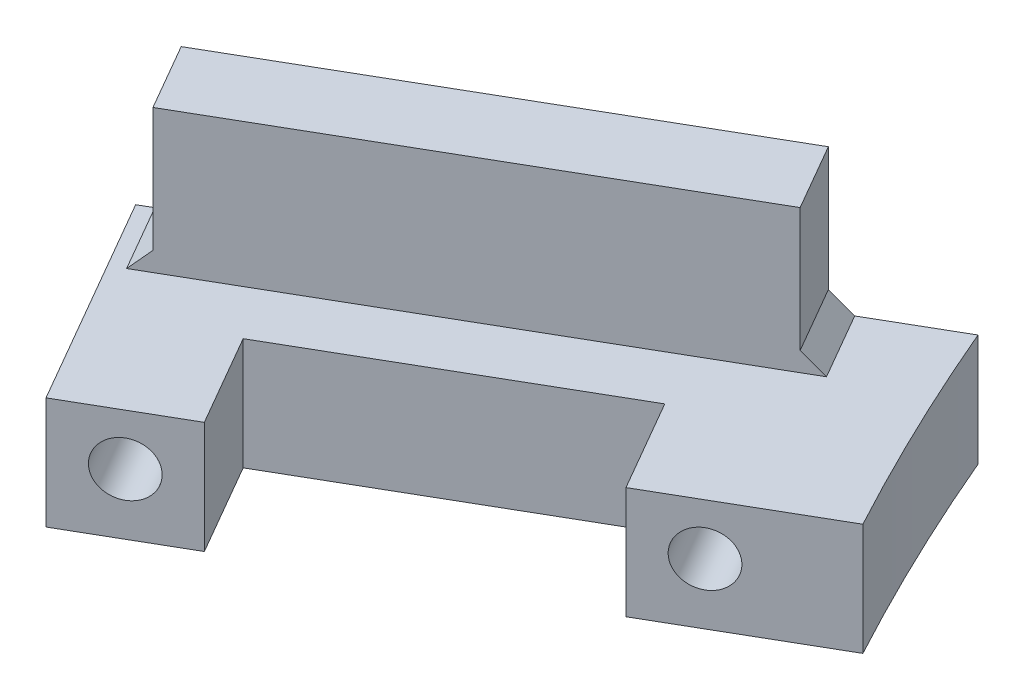
ISO-10303-21;
HEADER;
FILE_DESCRIPTION(('STEP AP214'),'2;1');
FILE_NAME('part.step','',(''),(''),'','','');
FILE_SCHEMA(('AUTOMOTIVE_DESIGN { 1 0 10303 214 1 1 1 1 }'));
ENDSEC;
DATA;
#1=APPLICATION_CONTEXT('core data for automotive mechanical design processes');
#2=APPLICATION_PROTOCOL_DEFINITION('international standard','automotive_design',2000,#1);
#3=PRODUCT_CONTEXT('',#1,'mechanical');
#4=PRODUCT('Part','Part','',(#3));
#5=PRODUCT_RELATED_PRODUCT_CATEGORY('part','',(#4));
#6=PRODUCT_DEFINITION_FORMATION('','',#4);
#7=PRODUCT_DEFINITION_CONTEXT('part definition',#1,'design');
#8=PRODUCT_DEFINITION('design','',#6,#7);
#9=PRODUCT_DEFINITION_SHAPE('','',#8);
#10=(LENGTH_UNIT() NAMED_UNIT(*) SI_UNIT(.MILLI.,.METRE.));
#11=(NAMED_UNIT(*) PLANE_ANGLE_UNIT() SI_UNIT($,.RADIAN.));
#12=(NAMED_UNIT(*) SI_UNIT($,.STERADIAN.) SOLID_ANGLE_UNIT());
#13=UNCERTAINTY_MEASURE_WITH_UNIT(LENGTH_MEASURE(1.E-05),#10,'distance_accuracy_value','');
#14=(GEOMETRIC_REPRESENTATION_CONTEXT(3) GLOBAL_UNCERTAINTY_ASSIGNED_CONTEXT((#13)) GLOBAL_UNIT_ASSIGNED_CONTEXT((#10,
#11,#12)) REPRESENTATION_CONTEXT('',''));
#15=CARTESIAN_POINT('',(0.,0.,0.));
#16=DIRECTION('',(0.,0.,1.));
#17=DIRECTION('',(1.,0.,0.));
#18=AXIS2_PLACEMENT_3D('',#15,#16,#17);
#19=CARTESIAN_POINT('',(4.79598622043922,0.,-14.4019340840513));
#20=DIRECTION('',(-0.866025403784438,0.,0.500000000000001));
#21=DIRECTION('',(0.500000000000001,0.,0.866025403784438));
#22=AXIS2_PLACEMENT_3D('',#19,#20,#21);
#23=PLANE('',#22);
#24=DIRECTION('',(0.500000000000001,0.,0.866025403784438));
#25=VECTOR('',#24,1.);
#26=CARTESIAN_POINT('',(4.79598622043923,2.90000000000004,-14.4019340840513));
#27=LINE('',#26,#25);
#28=CARTESIAN_POINT('',(8.45821005553815,2.90000000000004,-8.05877633297021));
#29=VERTEX_POINT('',#28);
#30=CARTESIAN_POINT('',(9.83321005553811,2.90000000000004,-5.67720647256308));
#31=VERTEX_POINT('',#30);
#32=EDGE_CURVE('E325',#29,#31,#27,.T.);
#33=ORIENTED_EDGE('',*,*,#32,.F.);
#34=DIRECTION('',(0.,-1.,0.));
#35=VECTOR('',#34,1.);
#36=CARTESIAN_POINT('',(8.45821005553814,0.,-8.05877633297021));
#37=LINE('',#36,#35);
#38=CARTESIAN_POINT('',(8.45821005553815,0.,-8.05877633297021));
#39=VERTEX_POINT('',#38);
#40=EDGE_CURVE('E294',#29,#39,#37,.T.);
#41=ORIENTED_EDGE('',*,*,#40,.T.);
#42=DIRECTION('',(0.500000000000001,0.,0.866025403784438));
#43=VECTOR('',#42,1.);
#44=CARTESIAN_POINT('',(4.79598622043922,0.,-14.4019340840513));
#45=LINE('',#44,#43);
#46=CARTESIAN_POINT('',(9.83321005553811,0.,-5.67720647256307));
#47=VERTEX_POINT('',#46);
#48=EDGE_CURVE('E301',#39,#47,#45,.T.);
#49=ORIENTED_EDGE('',*,*,#48,.T.);
#50=DIRECTION('',(0.,-1.,0.));
#51=VECTOR('',#50,1.);
#52=CARTESIAN_POINT('',(9.83321005553811,0.,-5.67720647256307));
#53=LINE('',#52,#51);
#54=EDGE_CURVE('E326',#31,#47,#53,.T.);
#55=ORIENTED_EDGE('',*,*,#54,.F.);
#56=EDGE_LOOP('',(#33,#41,#49,#55));
#57=FACE_BOUND('',#56,.T.);
#58=ADVANCED_FACE('F148',(#57),#23,.T.);
#59=CARTESIAN_POINT('',(-5.03722383509889,0.,-8.7247276114882));
#60=DIRECTION('',(0.,1.,0.));
#61=DIRECTION('',(0.,0.,1.));
#62=AXIS2_PLACEMENT_3D('',#59,#60,#61);
#63=PLANE('',#62);
#64=DIRECTION('',(0.500000000000001,0.,0.866025403784438));
#65=VECTOR('',#64,1.);
#66=CARTESIAN_POINT('',(-4.73411494377403,0.,-8.89972761148837));
#67=LINE('',#66,#65);
#68=CARTESIAN_POINT('',(-2.87089110867512,0.,-5.67252926322374));
#69=VERTEX_POINT('',#68);
#70=CARTESIAN_POINT('',(0.303108891324852,0.,-0.175000000000171));
#71=VERTEX_POINT('',#70);
#72=EDGE_CURVE('E346',#69,#71,#67,.T.);
#73=ORIENTED_EDGE('',*,*,#72,.F.);
#74=DIRECTION('',(-0.866025403784438,0.,0.500000000000001));
#75=VECTOR('',#74,1.);
#76=CARTESIAN_POINT('',(-3.17399999999997,0.,-5.49752926322356));
#77=LINE('',#76,#75);
#78=CARTESIAN_POINT('',(10.9712435700447,0.,-13.6642894461417));
#79=VERTEX_POINT('',#78);
#80=EDGE_CURVE('E355',#79,#69,#77,.T.);
#81=ORIENTED_EDGE('',*,*,#80,.F.);
#82=CARTESIAN_POINT('',(73.755313071795,0.,-40.2732487794075));
#83=DIRECTION('',(0.,1.,0.));
#84=DIRECTION('',(0.,0.,1.));
#85=AXIS2_PLACEMENT_3D('',#82,#83,#84);
#86=CIRCLE('',#85,68.19);
#87=CARTESIAN_POINT('',(13.726446616475,0.,-7.92496764903888));
#88=VERTEX_POINT('',#87);
#89=EDGE_CURVE('E287',#88,#79,#86,.F.);
#90=ORIENTED_EDGE('',*,*,#89,.F.);
#91=DIRECTION('',(-0.866025403784438,0.,0.500000000000001));
#92=VECTOR('',#91,1.);
#93=CARTESIAN_POINT('',(0.,0.,0.));
#94=LINE('',#93,#92);
#95=EDGE_CURVE('E293',#88,#47,#94,.T.);
#96=ORIENTED_EDGE('',*,*,#95,.T.);
#97=ORIENTED_EDGE('',*,*,#48,.F.);
#98=DIRECTION('',(-0.866025403784438,0.,0.500000000000001));
#99=VECTOR('',#98,1.);
#100=CARTESIAN_POINT('',(-1.37499999999996,0.,-2.38156986040714));
#101=LINE('',#100,#99);
#102=CARTESIAN_POINT('',(1.53000682526264,0.,-4.05877633297021));
#103=VERTEX_POINT('',#102);
#104=EDGE_CURVE('E304',#39,#103,#101,.T.);
#105=ORIENTED_EDGE('',*,*,#104,.T.);
#106=DIRECTION('',(0.500000000000001,0.,0.866025403784438));
#107=VECTOR('',#106,1.);
#108=CARTESIAN_POINT('',(-2.13221700983628,0.,-10.4019340840513));
#109=LINE('',#108,#107);
#110=CARTESIAN_POINT('',(2.9050068252626,0.,-1.67720647256307));
#111=VERTEX_POINT('',#110);
#112=EDGE_CURVE('E198',#103,#111,#109,.T.);
#113=ORIENTED_EDGE('',*,*,#112,.T.);
#114=DIRECTION('',(-0.866025403784438,0.,0.500000000000001));
#115=VECTOR('',#114,1.);
#116=CARTESIAN_POINT('',(0.,0.,0.));
#117=LINE('',#116,#115);
#118=EDGE_CURVE('E349',#111,#71,#117,.T.);
#119=ORIENTED_EDGE('',*,*,#118,.T.);
#120=EDGE_LOOP('',(#73,#81,#90,#96,#97,#105,#113,#119));
#121=FACE_BOUND('',#120,.T.);
#122=ADVANCED_FACE('F425',(#121),#63,.F.);
#123=CARTESIAN_POINT('',(6.09502432611589,1.57500000000004,-15.1519340840513));
#124=DIRECTION('',(0.500000000000001,0.,0.866025403784438));
#125=DIRECTION('',(0.866025403784438,0.,-0.500000000000001));
#126=AXIS2_PLACEMENT_3D('',#123,#124,#125);
#127=CYLINDRICAL_SURFACE('',#126,0.700000000000006);
#128=CARTESIAN_POINT('',(11.1322481612148,1.57500000000004,-6.42720647256308));
#129=DIRECTION('',(-0.500000000000001,0.,-0.866025403784438));
#130=DIRECTION('',(-0.866025403784438,0.,0.500000000000001));
#131=AXIS2_PLACEMENT_3D('',#128,#129,#130);
#132=CIRCLE('',#131,0.700000000000006);
#133=CARTESIAN_POINT('',(10.5260303785657,1.57500000000004,-6.07720647256308));
#134=VERTEX_POINT('',#133);
#135=EDGE_CURVE('E324',#134,#134,#132,.T.);
#136=ORIENTED_EDGE('',*,*,#135,.F.);
#137=EDGE_LOOP('',(#136));
#138=FACE_BOUND('',#137,.T.);
#139=CARTESIAN_POINT('',(8.9582481612148,1.57500000000004,-10.1926849282178));
#140=DIRECTION('',(-0.500000000000001,0.,-0.866025403784438));
#141=DIRECTION('',(-0.866025403784438,0.,0.500000000000001));
#142=AXIS2_PLACEMENT_3D('',#139,#140,#141);
#143=CIRCLE('',#142,0.700000000000006);
#144=CARTESIAN_POINT('',(8.35203037856569,1.57500000000004,-9.84268492821776));
#145=VERTEX_POINT('',#144);
#146=EDGE_CURVE('E404',#145,#145,#143,.T.);
#147=ORIENTED_EDGE('',*,*,#146,.T.);
#148=EDGE_LOOP('',(#147));
#149=FACE_BOUND('',#148,.T.);
#150=ADVANCED_FACE('F475',(#138,#149),#127,.F.);
#151=CARTESIAN_POINT('',(-5.03722383509889,2.90000000000004,-8.7247276114882));
#152=DIRECTION('',(0.,-1.,0.));
#153=DIRECTION('',(0.,0.,-1.));
#154=AXIS2_PLACEMENT_3D('',#151,#152,#153);
#155=PLANE('',#154);
#156=DIRECTION('',(0.866025403784438,0.,-0.500000000000001));
#157=VECTOR('',#156,1.);
#158=CARTESIAN_POINT('',(-3.17399999999997,2.90000000000004,-5.49752926322356));
#159=LINE('',#158,#157);
#160=CARTESIAN_POINT('',(8.94551712152908,2.90000000000004,-12.4947357357866));
#161=VERTEX_POINT('',#160);
#162=CARTESIAN_POINT('',(10.9712435700447,2.90000000000004,-13.6642894461417));
#163=VERTEX_POINT('',#162);
#164=EDGE_CURVE('E392',#161,#163,#159,.T.);
#165=ORIENTED_EDGE('',*,*,#164,.F.);
#166=DIRECTION('',(0.500000000000001,0.,0.866025403784438));
#167=VECTOR('',#166,1.);
#168=CARTESIAN_POINT('',(7.08229328643016,2.90000000000004,-15.7219340840513));
#169=LINE('',#168,#167);
#170=CARTESIAN_POINT('',(9.94551712152907,2.90000000000004,-10.7626849282178));
#171=VERTEX_POINT('',#170);
#172=EDGE_CURVE('E258',#161,#171,#169,.T.);
#173=ORIENTED_EDGE('',*,*,#172,.T.);
#174=DIRECTION('',(0.866025403784438,0.,-0.500000000000001));
#175=VECTOR('',#174,1.);
#176=CARTESIAN_POINT('',(-2.17399999999997,2.90000000000004,-3.76547845565469));
#177=LINE('',#176,#175);
#178=CARTESIAN_POINT('',(-1.55530024072827,2.90000000000004,-4.12268492821776));
#179=VERTEX_POINT('',#178);
#180=EDGE_CURVE('E401',#179,#171,#177,.T.);
#181=ORIENTED_EDGE('',*,*,#180,.F.);
#182=DIRECTION('',(-0.500000000000001,0.,-0.866025403784438));
#183=VECTOR('',#182,1.);
#184=CARTESIAN_POINT('',(-4.41852407582719,2.90000000000004,-9.08193408405128));
#185=LINE('',#184,#183);
#186=CARTESIAN_POINT('',(-2.55530024072828,2.90000000000004,-5.85473573578663));
#187=VERTEX_POINT('',#186);
#188=EDGE_CURVE('E329',#179,#187,#185,.T.);
#189=ORIENTED_EDGE('',*,*,#188,.T.);
#190=CARTESIAN_POINT('',(-2.87089110867512,2.90000000000004,-5.67252926322374));
#191=VERTEX_POINT('',#190);
#192=EDGE_CURVE('E354',#191,#187,#159,.T.);
#193=ORIENTED_EDGE('',*,*,#192,.F.);
#194=DIRECTION('',(0.500000000000001,0.,0.866025403784438));
#195=VECTOR('',#194,1.);
#196=CARTESIAN_POINT('',(-4.73411494377403,2.90000000000004,-8.89972761148838));
#197=LINE('',#196,#195);
#198=CARTESIAN_POINT('',(0.303108891324852,2.90000000000004,-0.175000000000172));
#199=VERTEX_POINT('',#198);
#200=EDGE_CURVE('E338',#191,#199,#197,.T.);
#201=ORIENTED_EDGE('',*,*,#200,.T.);
#202=DIRECTION('',(0.866025403784438,0.,-0.500000000000001));
#203=VECTOR('',#202,1.);
#204=CARTESIAN_POINT('',(0.,2.90000000000004,0.));
#205=LINE('',#204,#203);
#206=CARTESIAN_POINT('',(2.90500682526261,2.90000000000004,-1.67720647256307));
#207=VERTEX_POINT('',#206);
#208=EDGE_CURVE('E341',#199,#207,#205,.T.);
#209=ORIENTED_EDGE('',*,*,#208,.T.);
#210=DIRECTION('',(0.500000000000001,0.,0.866025403784438));
#211=VECTOR('',#210,1.);
#212=CARTESIAN_POINT('',(-2.13221700983628,2.90000000000004,-10.4019340840513));
#213=LINE('',#212,#211);
#214=CARTESIAN_POINT('',(1.53000682526264,2.90000000000004,-4.05877633297021));
#215=VERTEX_POINT('',#214);
#216=EDGE_CURVE('E411',#215,#207,#213,.T.);
#217=ORIENTED_EDGE('',*,*,#216,.F.);
#218=DIRECTION('',(-0.866025403784438,0.,0.500000000000001));
#219=VECTOR('',#218,1.);
#220=CARTESIAN_POINT('',(-1.37499999999996,2.90000000000004,-2.38156986040714));
#221=LINE('',#220,#219);
#222=EDGE_CURVE('E315',#29,#215,#221,.T.);
#223=ORIENTED_EDGE('',*,*,#222,.F.);
#224=ORIENTED_EDGE('',*,*,#32,.T.);
#225=DIRECTION('',(0.866025403784438,0.,-0.500000000000001));
#226=VECTOR('',#225,1.);
#227=CARTESIAN_POINT('',(0.,2.90000000000004,0.));
#228=LINE('',#227,#226);
#229=CARTESIAN_POINT('',(13.726446616475,2.90000000000004,-7.92496764903888));
#230=VERTEX_POINT('',#229);
#231=EDGE_CURVE('E186',#31,#230,#228,.T.);
#232=ORIENTED_EDGE('',*,*,#231,.T.);
#233=CARTESIAN_POINT('',(73.755313071795,2.90000000000004,-40.2732487794075));
#234=DIRECTION('',(0.,-1.,0.));
#235=DIRECTION('',(0.,0.,-1.));
#236=AXIS2_PLACEMENT_3D('',#233,#234,#235);
#237=CIRCLE('',#236,68.19);
#238=EDGE_CURVE('E152',#163,#230,#237,.F.);
#239=ORIENTED_EDGE('',*,*,#238,.F.);
#240=EDGE_LOOP('',(#165,#173,#181,#189,#193,#201,#209,#217,#223,#224,#232,#239));
#241=FACE_BOUND('',#240,.T.);
#242=ADVANCED_FACE('F445',(#241),#155,.F.);
#243=CARTESIAN_POINT('',(0.,0.,0.));
#244=DIRECTION('',(-0.500000000000001,0.,-0.866025403784438));
#245=DIRECTION('',(-0.866025403784438,0.,0.500000000000001));
#246=AXIS2_PLACEMENT_3D('',#243,#244,#245);
#247=PLANE('',#246);
#248=ORIENTED_EDGE('',*,*,#135,.T.);
#249=EDGE_LOOP('',(#248));
#250=FACE_BOUND('',#249,.T.);
#251=DIRECTION('',(0.,-1.,0.));
#252=VECTOR('',#251,1.);
#253=CARTESIAN_POINT('',(13.726446616475,9.45898306811788,-7.92496764903887));
#254=LINE('',#253,#252);
#255=EDGE_CURVE('E290',#230,#88,#254,.T.);
#256=ORIENTED_EDGE('',*,*,#255,.F.);
#257=ORIENTED_EDGE('',*,*,#231,.F.);
#258=ORIENTED_EDGE('',*,*,#54,.T.);
#259=ORIENTED_EDGE('',*,*,#95,.F.);
#260=EDGE_LOOP('',(#256,#257,#258,#259));
#261=FACE_BOUND('',#260,.T.);
#262=ADVANCED_FACE('F443',(#250,#261),#247,.F.);
#263=CARTESIAN_POINT('',(4.12545276268859,3.55000000000004,-5.5572577436102));
#264=DIRECTION('',(0.500000000000001,0.,0.866025403784438));
#265=DIRECTION('',(0.,1.,0.));
#266=AXIS2_PLACEMENT_3D('',#263,#264,#265);
#267=PLANE('',#266);
#268=ORIENTED_EDGE('',*,*,#40,.F.);
#269=ORIENTED_EDGE('',*,*,#222,.T.);
#270=DIRECTION('',(0.,-1.,0.));
#271=VECTOR('',#270,1.);
#272=CARTESIAN_POINT('',(1.53000682526264,0.,-4.05877633297021));
#273=LINE('',#272,#271);
#274=EDGE_CURVE('E311',#215,#103,#273,.T.);
#275=ORIENTED_EDGE('',*,*,#274,.T.);
#276=ORIENTED_EDGE('',*,*,#104,.F.);
#277=EDGE_LOOP('',(#268,#269,#275,#276));
#278=FACE_BOUND('',#277,.T.);
#279=ADVANCED_FACE('F447',(#278),#267,.T.);
#280=CARTESIAN_POINT('',(-4.73411494377403,0.,-8.89972761148837));
#281=DIRECTION('',(0.866025403784438,0.,-0.500000000000001));
#282=DIRECTION('',(-0.500000000000001,0.,-0.866025403784438));
#283=AXIS2_PLACEMENT_3D('',#280,#281,#282);
#284=PLANE('',#283);
#285=ORIENTED_EDGE('',*,*,#200,.F.);
#286=DIRECTION('',(0.,1.,0.));
#287=VECTOR('',#286,1.);
#288=CARTESIAN_POINT('',(-2.87089110867512,0.,-5.67252926322374));
#289=LINE('',#288,#287);
#290=EDGE_CURVE('E350',#69,#191,#289,.T.);
#291=ORIENTED_EDGE('',*,*,#290,.F.);
#292=ORIENTED_EDGE('',*,*,#72,.T.);
#293=DIRECTION('',(0.,1.,0.));
#294=VECTOR('',#293,1.);
#295=CARTESIAN_POINT('',(0.303108891324851,0.,-0.175000000000173));
#296=LINE('',#295,#294);
#297=EDGE_CURVE('E342',#71,#199,#296,.T.);
#298=ORIENTED_EDGE('',*,*,#297,.T.);
#299=EDGE_LOOP('',(#285,#291,#292,#298));
#300=FACE_BOUND('',#299,.T.);
#301=ADVANCED_FACE('F437',(#300),#284,.F.);
#302=CARTESIAN_POINT('',(-3.43125511551294,1.57500000000004,-9.65193408405127));
#303=DIRECTION('',(0.500000000000001,0.,0.866025403784438));
#304=DIRECTION('',(0.866025403784438,0.,-0.500000000000001));
#305=AXIS2_PLACEMENT_3D('',#302,#303,#304);
#306=CYLINDRICAL_SURFACE('',#305,0.70000000000002);
#307=CARTESIAN_POINT('',(1.60596871958594,1.57500000000004,-0.927206472563067));
#308=DIRECTION('',(-0.500000000000001,0.,-0.866025403784438));
#309=DIRECTION('',(-0.866025403784438,0.,0.500000000000001));
#310=AXIS2_PLACEMENT_3D('',#307,#308,#309);
#311=CIRCLE('',#310,0.70000000000002);
#312=CARTESIAN_POINT('',(0.999750936936821,1.57500000000004,-0.577206472563056));
#313=VERTEX_POINT('',#312);
#314=EDGE_CURVE('E319',#313,#313,#311,.T.);
#315=ORIENTED_EDGE('',*,*,#314,.F.);
#316=EDGE_LOOP('',(#315));
#317=FACE_BOUND('',#316,.T.);
#318=CARTESIAN_POINT('',(-0.568031280414029,1.57500000000004,-4.69268492821775));
#319=DIRECTION('',(-0.500000000000001,0.,-0.866025403784438));
#320=DIRECTION('',(-0.866025403784438,0.,0.500000000000001));
#321=AXIS2_PLACEMENT_3D('',#318,#319,#320);
#322=CIRCLE('',#321,0.70000000000002);
#323=CARTESIAN_POINT('',(-1.17424906306315,1.57500000000004,-4.34268492821774));
#324=VERTEX_POINT('',#323);
#325=EDGE_CURVE('E391',#324,#324,#322,.T.);
#326=ORIENTED_EDGE('',*,*,#325,.T.);
#327=EDGE_LOOP('',(#326));
#328=FACE_BOUND('',#327,.T.);
#329=ADVANCED_FACE('F481',(#317,#328),#306,.F.);
#330=CARTESIAN_POINT('',(-2.13221700983628,0.,-10.4019340840513));
#331=DIRECTION('',(-0.866025403784438,0.,0.500000000000001));
#332=DIRECTION('',(0.500000000000001,0.,0.866025403784438));
#333=AXIS2_PLACEMENT_3D('',#330,#331,#332);
#334=PLANE('',#333);
#335=ORIENTED_EDGE('',*,*,#274,.F.);
#336=ORIENTED_EDGE('',*,*,#216,.T.);
#337=DIRECTION('',(0.,-1.,0.));
#338=VECTOR('',#337,1.);
#339=CARTESIAN_POINT('',(2.9050068252626,0.,-1.67720647256307));
#340=LINE('',#339,#338);
#341=EDGE_CURVE('E408',#207,#111,#340,.T.);
#342=ORIENTED_EDGE('',*,*,#341,.T.);
#343=ORIENTED_EDGE('',*,*,#112,.F.);
#344=EDGE_LOOP('',(#335,#336,#342,#343));
#345=FACE_BOUND('',#344,.T.);
#346=ADVANCED_FACE('F430',(#345),#334,.F.);
#347=CARTESIAN_POINT('',(0.,0.,0.));
#348=DIRECTION('',(-0.500000000000001,0.,-0.866025403784438));
#349=DIRECTION('',(-0.866025403784438,0.,0.500000000000001));
#350=AXIS2_PLACEMENT_3D('',#347,#348,#349);
#351=PLANE('',#350);
#352=ORIENTED_EDGE('',*,*,#314,.T.);
#353=EDGE_LOOP('',(#352));
#354=FACE_BOUND('',#353,.T.);
#355=ORIENTED_EDGE('',*,*,#118,.F.);
#356=ORIENTED_EDGE('',*,*,#341,.F.);
#357=ORIENTED_EDGE('',*,*,#208,.F.);
#358=ORIENTED_EDGE('',*,*,#297,.F.);
#359=EDGE_LOOP('',(#355,#356,#357,#358));
#360=FACE_BOUND('',#359,.T.);
#361=ADVANCED_FACE('F435',(#354,#360),#351,.F.);
#362=CARTESIAN_POINT('',(-2.17399999999997,0.,-3.76547845565469));
#363=DIRECTION('',(-0.500000000000001,0.,-0.866025403784438));
#364=DIRECTION('',(-0.866025403784438,0.,0.500000000000001));
#365=AXIS2_PLACEMENT_3D('',#362,#363,#364);
#366=PLANE('',#365);
#367=ORIENTED_EDGE('',*,*,#325,.F.);
#368=EDGE_LOOP('',(#367));
#369=FACE_BOUND('',#368,.T.);
#370=ADVANCED_FACE('F510',(#369),#366,.F.);
#371=CARTESIAN_POINT('',(-3.17399999999997,0.,-5.49752926322356));
#372=DIRECTION('',(-0.500000000000001,0.,-0.866025403784438));
#373=DIRECTION('',(-0.866025403784438,0.,0.500000000000001));
#374=AXIS2_PLACEMENT_3D('',#371,#372,#373);
#375=PLANE('',#374);
#376=DIRECTION('',(-0.866025403784438,0.,0.500000000000001));
#377=VECTOR('',#376,1.);
#378=CARTESIAN_POINT('',(-3.17399999999997,6.60718814339274,-5.49752926322356));
#379=LINE('',#378,#377);
#380=CARTESIAN_POINT('',(8.51250441963684,6.60718814339274,-12.2447357357866));
#381=VERTEX_POINT('',#380);
#382=CARTESIAN_POINT('',(-2.12228753883606,6.60718814339274,-6.10473573578663));
#383=VERTEX_POINT('',#382);
#384=EDGE_CURVE('E266',#381,#383,#379,.T.);
#385=ORIENTED_EDGE('',*,*,#384,.F.);
#386=DIRECTION('',(0.,1.,0.));
#387=VECTOR('',#386,1.);
#388=CARTESIAN_POINT('',(8.51250441963684,0.,-12.2447357357866));
#389=LINE('',#388,#387);
#390=CARTESIAN_POINT('',(8.51250441963684,3.40000000000005,-12.2447357357866));
#391=VERTEX_POINT('',#390);
#392=EDGE_CURVE('E249',#391,#381,#389,.T.);
#393=ORIENTED_EDGE('',*,*,#392,.F.);
#394=DIRECTION('',(0.612372435695798,-0.707106781186543,-0.353553390593276));
#395=VECTOR('',#394,1.);
#396=CARTESIAN_POINT('',(8.94551712152907,2.90000000000004,-12.4947357357866));
#397=LINE('',#396,#395);
#398=EDGE_CURVE('E263',#391,#161,#397,.T.);
#399=ORIENTED_EDGE('',*,*,#398,.T.);
#400=ORIENTED_EDGE('',*,*,#164,.T.);
#401=DIRECTION('',(0.,-1.,0.));
#402=VECTOR('',#401,1.);
#403=CARTESIAN_POINT('',(10.9712435700447,9.45898306811788,-13.6642894461417));
#404=LINE('',#403,#402);
#405=EDGE_CURVE('E283',#163,#79,#404,.T.);
#406=ORIENTED_EDGE('',*,*,#405,.T.);
#407=ORIENTED_EDGE('',*,*,#80,.T.);
#408=ORIENTED_EDGE('',*,*,#290,.T.);
#409=ORIENTED_EDGE('',*,*,#192,.T.);
#410=DIRECTION('',(0.612372435695791,0.707106781186551,-0.353553390593272));
#411=VECTOR('',#410,1.);
#412=CARTESIAN_POINT('',(-2.12228753883606,3.40000000000005,-6.10473573578663));
#413=LINE('',#412,#411);
#414=CARTESIAN_POINT('',(-2.12228753883606,3.40000000000005,-6.10473573578663));
#415=VERTEX_POINT('',#414);
#416=EDGE_CURVE('E14',#187,#415,#413,.T.);
#417=ORIENTED_EDGE('',*,*,#416,.T.);
#418=DIRECTION('',(0.,-1.,0.));
#419=VECTOR('',#418,1.);
#420=CARTESIAN_POINT('',(-2.12228753883606,0.,-6.10473573578663));
#421=LINE('',#420,#419);
#422=EDGE_CURVE('E268',#383,#415,#421,.T.);
#423=ORIENTED_EDGE('',*,*,#422,.F.);
#424=EDGE_LOOP('',(#385,#393,#399,#400,#406,#407,#408,#409,#417,#423));
#425=FACE_BOUND('',#424,.T.);
#426=ADVANCED_FACE('F261',(#425),#375,.T.);
#427=CARTESIAN_POINT('',(-3.17399999999997,6.60718814339274,-5.49752926322356));
#428=DIRECTION('',(0.,1.,0.));
#429=DIRECTION('',(0.,0.,1.));
#430=AXIS2_PLACEMENT_3D('',#427,#428,#429);
#431=PLANE('',#430);
#432=DIRECTION('',(-0.866025403784438,0.,0.500000000000001));
#433=VECTOR('',#432,1.);
#434=CARTESIAN_POINT('',(-2.17399999999997,6.60718814339274,-3.76547845565469));
#435=LINE('',#434,#433);
#436=CARTESIAN_POINT('',(9.51250441963684,6.60718814339274,-10.5126849282178));
#437=VERTEX_POINT('',#436);
#438=CARTESIAN_POINT('',(-1.12228753883606,6.60718814339274,-4.37268492821776));
#439=VERTEX_POINT('',#438);
#440=EDGE_CURVE('E375',#437,#439,#435,.T.);
#441=ORIENTED_EDGE('',*,*,#440,.F.);
#442=DIRECTION('',(0.500000000000001,0.,0.866025403784438));
#443=VECTOR('',#442,1.);
#444=CARTESIAN_POINT('',(8.51250441963684,6.60718814339274,-12.2447357357866));
#445=LINE('',#444,#443);
#446=EDGE_CURVE('E388',#381,#437,#445,.T.);
#447=ORIENTED_EDGE('',*,*,#446,.F.);
#448=ORIENTED_EDGE('',*,*,#384,.T.);
#449=DIRECTION('',(0.500000000000001,0.,0.866025403784438));
#450=VECTOR('',#449,1.);
#451=CARTESIAN_POINT('',(-2.12228753883606,6.60718814339274,-6.10473573578663));
#452=LINE('',#451,#450);
#453=EDGE_CURVE('E384',#383,#439,#452,.T.);
#454=ORIENTED_EDGE('',*,*,#453,.T.);
#455=EDGE_LOOP('',(#441,#447,#448,#454));
#456=FACE_BOUND('',#455,.T.);
#457=ADVANCED_FACE('F453',(#456),#431,.T.);
#458=CARTESIAN_POINT('',(-2.12228753883606,0.,-6.10473573578663));
#459=DIRECTION('',(-0.866025403784438,0.,0.500000000000001));
#460=DIRECTION('',(0.500000000000001,0.,0.866025403784438));
#461=AXIS2_PLACEMENT_3D('',#458,#459,#460);
#462=PLANE('',#461);
#463=ORIENTED_EDGE('',*,*,#422,.T.);
#464=DIRECTION('',(0.500000000000001,0.,0.866025403784438));
#465=VECTOR('',#464,1.);
#466=CARTESIAN_POINT('',(-2.12228753883606,3.40000000000005,-6.10473573578663));
#467=LINE('',#466,#465);
#468=CARTESIAN_POINT('',(-1.12228753883606,3.40000000000005,-4.37268492821776));
#469=VERTEX_POINT('',#468);
#470=EDGE_CURVE('E257',#415,#469,#467,.T.);
#471=ORIENTED_EDGE('',*,*,#470,.T.);
#472=DIRECTION('',(0.,-1.,0.));
#473=VECTOR('',#472,1.);
#474=CARTESIAN_POINT('',(-1.12228753883606,0.,-4.37268492821776));
#475=LINE('',#474,#473);
#476=EDGE_CURVE('E368',#439,#469,#475,.T.);
#477=ORIENTED_EDGE('',*,*,#476,.F.);
#478=ORIENTED_EDGE('',*,*,#453,.F.);
#479=EDGE_LOOP('',(#463,#471,#477,#478));
#480=FACE_BOUND('',#479,.T.);
#481=ADVANCED_FACE('F365',(#480),#462,.T.);
#482=ORIENTED_EDGE('',*,*,#476,.T.);
#483=DIRECTION('',(-0.612372435695791,-0.707106781186551,0.353553390593272));
#484=VECTOR('',#483,1.);
#485=CARTESIAN_POINT('',(-3.12038695585157,1.09279352743693,-3.21908169193621));
#486=LINE('',#485,#484);
#487=EDGE_CURVE('E159',#469,#179,#486,.T.);
#488=ORIENTED_EDGE('',*,*,#487,.T.);
#489=ORIENTED_EDGE('',*,*,#180,.T.);
#490=DIRECTION('',(-0.612372435695798,0.707106781186543,0.353553390593276));
#491=VECTOR('',#490,1.);
#492=CARTESIAN_POINT('',(5.14149539625193,8.44720647256311,-7.9890816919362));
#493=LINE('',#492,#491);
#494=CARTESIAN_POINT('',(9.51250441963684,3.40000000000005,-10.5126849282178));
#495=VERTEX_POINT('',#494);
#496=EDGE_CURVE('E274',#171,#495,#493,.T.);
#497=ORIENTED_EDGE('',*,*,#496,.T.);
#498=DIRECTION('',(0.,1.,0.));
#499=VECTOR('',#498,1.);
#500=CARTESIAN_POINT('',(9.51250441963684,0.,-10.5126849282178));
#501=LINE('',#500,#499);
#502=EDGE_CURVE('E252',#495,#437,#501,.T.);
#503=ORIENTED_EDGE('',*,*,#502,.T.);
#504=ORIENTED_EDGE('',*,*,#440,.T.);
#505=EDGE_LOOP('',(#482,#488,#489,#497,#503,#504));
#506=FACE_BOUND('',#505,.T.);
#507=ADVANCED_FACE('F372',(#506),#366,.F.);
#508=CARTESIAN_POINT('',(8.51250441963684,0.,-12.2447357357866));
#509=DIRECTION('',(0.866025403784438,0.,-0.500000000000001));
#510=DIRECTION('',(-0.500000000000001,0.,-0.866025403784438));
#511=AXIS2_PLACEMENT_3D('',#508,#509,#510);
#512=PLANE('',#511);
#513=ORIENTED_EDGE('',*,*,#502,.F.);
#514=DIRECTION('',(-0.500000000000001,0.,-0.866025403784438));
#515=VECTOR('',#514,1.);
#516=CARTESIAN_POINT('',(8.51250441963684,3.40000000000005,-12.2447357357866));
#517=LINE('',#516,#515);
#518=EDGE_CURVE('E244',#495,#391,#517,.T.);
#519=ORIENTED_EDGE('',*,*,#518,.T.);
#520=ORIENTED_EDGE('',*,*,#392,.T.);
#521=ORIENTED_EDGE('',*,*,#446,.T.);
#522=EDGE_LOOP('',(#513,#519,#520,#521));
#523=FACE_BOUND('',#522,.T.);
#524=ADVANCED_FACE('F246',(#523),#512,.T.);
#525=ORIENTED_EDGE('',*,*,#146,.F.);
#526=EDGE_LOOP('',(#525));
#527=FACE_BOUND('',#526,.T.);
#528=ADVANCED_FACE('F466',(#527),#366,.F.);
#529=CARTESIAN_POINT('',(7.08229328643016,2.90000000000004,-15.7219340840513));
#530=DIRECTION('',(-0.612372435695791,-0.707106781186552,0.353553390593272));
#531=DIRECTION('',(0.500000000000001,0.,0.866025403784438));
#532=AXIS2_PLACEMENT_3D('',#529,#530,#531);
#533=PLANE('',#532);
#534=ORIENTED_EDGE('',*,*,#398,.F.);
#535=ORIENTED_EDGE('',*,*,#518,.F.);
#536=ORIENTED_EDGE('',*,*,#496,.F.);
#537=ORIENTED_EDGE('',*,*,#172,.F.);
#538=EDGE_LOOP('',(#534,#535,#536,#537));
#539=FACE_BOUND('',#538,.T.);
#540=ADVANCED_FACE('F271',(#539),#533,.F.);
#541=CARTESIAN_POINT('',(-2.12228753883606,3.40000000000005,-6.10473573578663));
#542=DIRECTION('',(0.612372435695798,-0.707106781186544,-0.353553390593276));
#543=DIRECTION('',(0.500000000000001,0.,0.866025403784438));
#544=AXIS2_PLACEMENT_3D('',#541,#542,#543);
#545=PLANE('',#544);
#546=ORIENTED_EDGE('',*,*,#416,.F.);
#547=ORIENTED_EDGE('',*,*,#188,.F.);
#548=ORIENTED_EDGE('',*,*,#487,.F.);
#549=ORIENTED_EDGE('',*,*,#470,.F.);
#550=EDGE_LOOP('',(#546,#547,#548,#549));
#551=FACE_BOUND('',#550,.T.);
#552=ADVANCED_FACE('F458',(#551),#545,.F.);
#553=CARTESIAN_POINT('',(73.755313071795,9.45898306811788,-40.2732487794075));
#554=DIRECTION('',(0.,-1.,0.));
#555=DIRECTION('',(0.,0.,-1.));
#556=AXIS2_PLACEMENT_3D('',#553,#554,#555);
#557=CYLINDRICAL_SURFACE('',#556,68.19);
#558=ORIENTED_EDGE('',*,*,#405,.F.);
#559=ORIENTED_EDGE('',*,*,#238,.T.);
#560=ORIENTED_EDGE('',*,*,#255,.T.);
#561=ORIENTED_EDGE('',*,*,#89,.T.);
#562=EDGE_LOOP('',(#558,#559,#560,#561));
#563=FACE_BOUND('',#562,.T.);
#564=ADVANCED_FACE('F150',(#563),#557,.F.);
#565=CLOSED_SHELL('',(#58,#122,#150,#242,#262,#279,#301,#329,#346,#361,#370,#426,#457,#481,#507,
#524,#528,#540,#552,#564));
#566=MANIFOLD_SOLID_BREP('B2',#565);
#567=ADVANCED_BREP_SHAPE_REPRESENTATION('',(#18,#566),#14);
#568=SHAPE_DEFINITION_REPRESENTATION(#9,#567);
ENDSEC;
END-ISO-10303-21;
